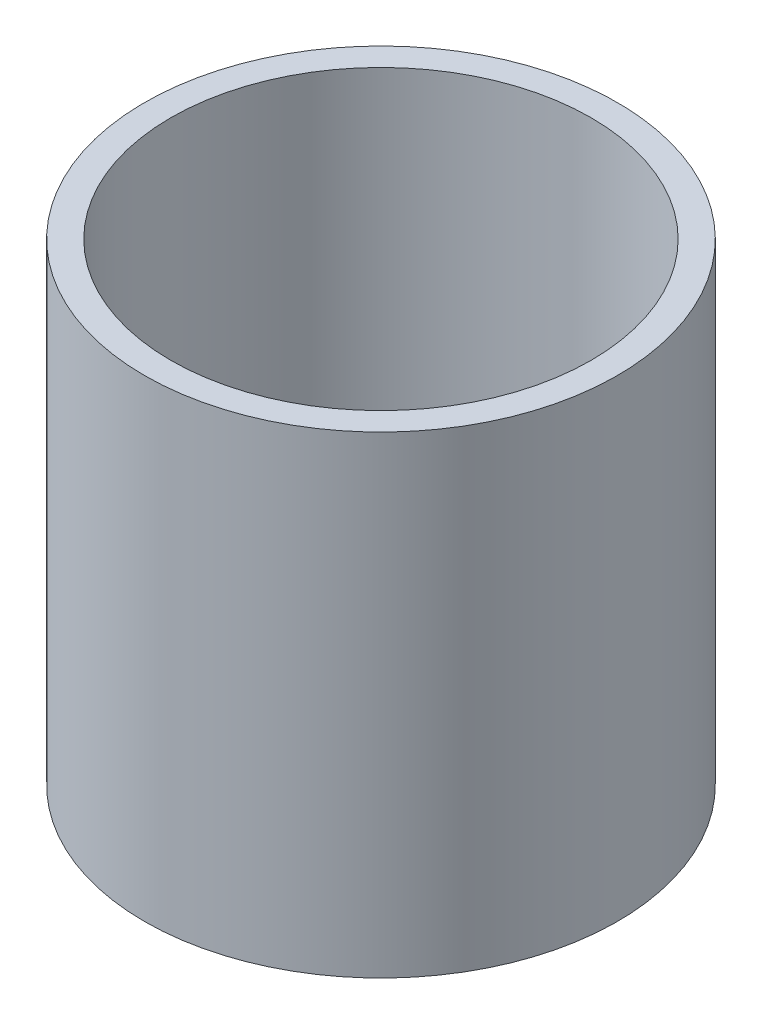
ISO-10303-21;
HEADER;
FILE_DESCRIPTION(('STEP AP214'),'2;1');
FILE_NAME('part.step','',(''),(''),'','','');
FILE_SCHEMA(('AUTOMOTIVE_DESIGN { 1 0 10303 214 1 1 1 1 }'));
ENDSEC;
DATA;
#1=APPLICATION_CONTEXT('core data for automotive mechanical design processes');
#2=APPLICATION_PROTOCOL_DEFINITION('international standard','automotive_design',2000,#1);
#3=PRODUCT_CONTEXT('',#1,'mechanical');
#4=PRODUCT('Part','Part','',(#3));
#5=PRODUCT_RELATED_PRODUCT_CATEGORY('part','',(#4));
#6=PRODUCT_DEFINITION_FORMATION('','',#4);
#7=PRODUCT_DEFINITION_CONTEXT('part definition',#1,'design');
#8=PRODUCT_DEFINITION('design','',#6,#7);
#9=PRODUCT_DEFINITION_SHAPE('','',#8);
#10=(LENGTH_UNIT() NAMED_UNIT(*) SI_UNIT(.MILLI.,.METRE.));
#11=(NAMED_UNIT(*) PLANE_ANGLE_UNIT() SI_UNIT($,.RADIAN.));
#12=(NAMED_UNIT(*) SI_UNIT($,.STERADIAN.) SOLID_ANGLE_UNIT());
#13=UNCERTAINTY_MEASURE_WITH_UNIT(LENGTH_MEASURE(1.E-05),#10,'distance_accuracy_value','');
#14=(GEOMETRIC_REPRESENTATION_CONTEXT(3) GLOBAL_UNCERTAINTY_ASSIGNED_CONTEXT((#13)) GLOBAL_UNIT_ASSIGNED_CONTEXT((#10,
#11,#12)) REPRESENTATION_CONTEXT('',''));
#15=CARTESIAN_POINT('',(0.,0.,0.));
#16=DIRECTION('',(0.,0.,1.));
#17=DIRECTION('',(1.,0.,0.));
#18=AXIS2_PLACEMENT_3D('',#15,#16,#17);
#19=CARTESIAN_POINT('',(0.,18.,0.));
#20=DIRECTION('',(0.,-1.,0.));
#21=DIRECTION('',(0.,0.,-1.));
#22=AXIS2_PLACEMENT_3D('',#19,#20,#21);
#23=CYLINDRICAL_SURFACE('',#22,9.);
#24=CARTESIAN_POINT('',(0.,18.,0.));
#25=DIRECTION('',(0.,1.,0.));
#26=DIRECTION('',(0.,0.,1.));
#27=AXIS2_PLACEMENT_3D('',#24,#25,#26);
#28=CIRCLE('',#27,9.);
#29=CARTESIAN_POINT('',(0.,18.,9.));
#30=VERTEX_POINT('',#29);
#31=EDGE_CURVE('E10',#30,#30,#28,.T.);
#32=ORIENTED_EDGE('',*,*,#31,.F.);
#33=EDGE_LOOP('',(#32));
#34=FACE_BOUND('',#33,.T.);
#35=CARTESIAN_POINT('',(0.,0.,0.));
#36=DIRECTION('',(0.,1.,0.));
#37=DIRECTION('',(0.,0.,1.));
#38=AXIS2_PLACEMENT_3D('',#35,#36,#37);
#39=CIRCLE('',#38,9.);
#40=CARTESIAN_POINT('',(0.,0.,9.));
#41=VERTEX_POINT('',#40);
#42=EDGE_CURVE('E40',#41,#41,#39,.T.);
#43=ORIENTED_EDGE('',*,*,#42,.T.);
#44=EDGE_LOOP('',(#43));
#45=FACE_BOUND('',#44,.T.);
#46=ADVANCED_FACE('F37',(#34,#45),#23,.T.);
#47=CARTESIAN_POINT('',(0.,18.,0.));
#48=DIRECTION('',(0.,1.,0.));
#49=DIRECTION('',(0.,0.,1.));
#50=AXIS2_PLACEMENT_3D('',#47,#48,#49);
#51=PLANE('',#50);
#52=CARTESIAN_POINT('',(0.,18.,0.));
#53=DIRECTION('',(0.,1.,0.));
#54=DIRECTION('',(0.,0.,1.));
#55=AXIS2_PLACEMENT_3D('',#52,#53,#54);
#56=CIRCLE('',#55,8.);
#57=CARTESIAN_POINT('',(0.,18.,8.));
#58=VERTEX_POINT('',#57);
#59=EDGE_CURVE('E49',#58,#58,#56,.T.);
#60=ORIENTED_EDGE('',*,*,#59,.F.);
#61=EDGE_LOOP('',(#60));
#62=FACE_BOUND('',#61,.T.);
#63=ORIENTED_EDGE('',*,*,#31,.T.);
#64=EDGE_LOOP('',(#63));
#65=FACE_BOUND('',#64,.T.);
#66=ADVANCED_FACE('F71',(#62,#65),#51,.T.);
#67=CARTESIAN_POINT('',(0.,0.,0.));
#68=DIRECTION('',(0.,1.,0.));
#69=DIRECTION('',(0.,0.,1.));
#70=AXIS2_PLACEMENT_3D('',#67,#68,#69);
#71=PLANE('',#70);
#72=ORIENTED_EDGE('',*,*,#42,.F.);
#73=EDGE_LOOP('',(#72));
#74=FACE_BOUND('',#73,.T.);
#75=ADVANCED_FACE('F63',(#74),#71,.F.);
#76=CARTESIAN_POINT('',(0.,18.,0.));
#77=DIRECTION('',(0.,-1.,0.));
#78=DIRECTION('',(0.,0.,-1.));
#79=AXIS2_PLACEMENT_3D('',#76,#77,#78);
#80=CYLINDRICAL_SURFACE('',#79,8.);
#81=ORIENTED_EDGE('',*,*,#59,.T.);
#82=EDGE_LOOP('',(#81));
#83=FACE_BOUND('',#82,.T.);
#84=CARTESIAN_POINT('',(0.,1.,0.));
#85=DIRECTION('',(0.,1.,0.));
#86=DIRECTION('',(0.,0.,1.));
#87=AXIS2_PLACEMENT_3D('',#84,#85,#86);
#88=CIRCLE('',#87,8.);
#89=CARTESIAN_POINT('',(0.,1.,8.));
#90=VERTEX_POINT('',#89);
#91=EDGE_CURVE('E54',#90,#90,#88,.T.);
#92=ORIENTED_EDGE('',*,*,#91,.F.);
#93=EDGE_LOOP('',(#92));
#94=FACE_BOUND('',#93,.T.);
#95=ADVANCED_FACE('F61',(#83,#94),#80,.F.);
#96=CARTESIAN_POINT('',(0.,1.,0.));
#97=DIRECTION('',(0.,1.,0.));
#98=DIRECTION('',(0.,0.,1.));
#99=AXIS2_PLACEMENT_3D('',#96,#97,#98);
#100=PLANE('',#99);
#101=ORIENTED_EDGE('',*,*,#91,.T.);
#102=EDGE_LOOP('',(#101));
#103=FACE_BOUND('',#102,.T.);
#104=ADVANCED_FACE('F59',(#103),#100,.T.);
#105=CLOSED_SHELL('',(#46,#66,#75,#95,#104));
#106=MANIFOLD_SOLID_BREP('B2',#105);
#107=ADVANCED_BREP_SHAPE_REPRESENTATION('',(#18,#106),#14);
#108=SHAPE_DEFINITION_REPRESENTATION(#9,#107);
ENDSEC;
END-ISO-10303-21;
